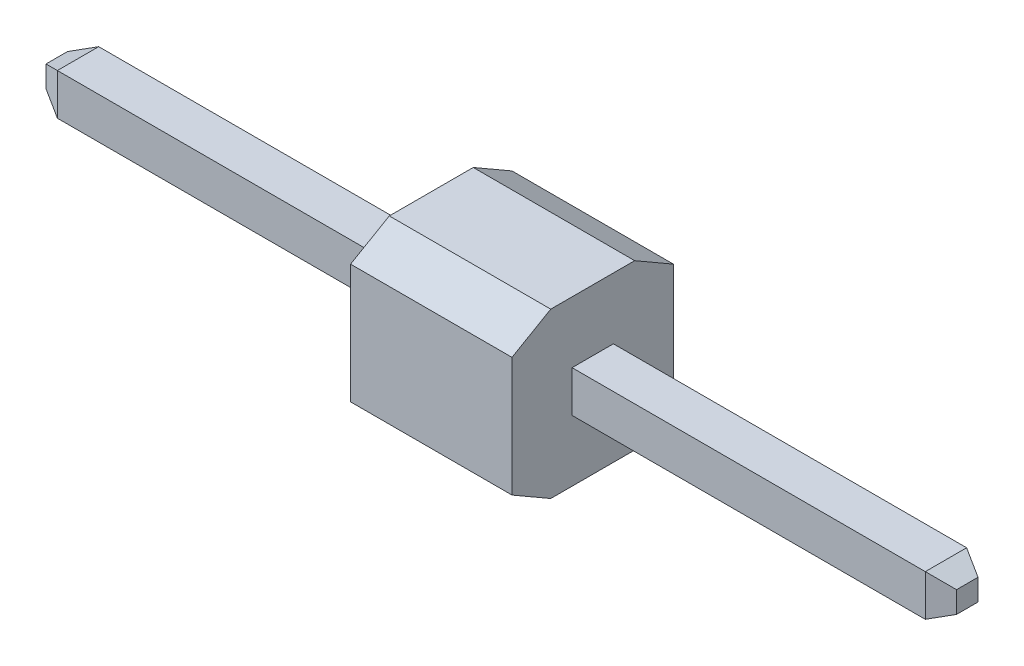
ISO-10303-21;
HEADER;
FILE_DESCRIPTION(('STEP AP214'),'2;1');
FILE_NAME('part.step','',(''),(''),'','','');
FILE_SCHEMA(('AUTOMOTIVE_DESIGN { 1 0 10303 214 1 1 1 1 }'));
ENDSEC;
DATA;
#1=APPLICATION_CONTEXT('core data for automotive mechanical design processes');
#2=APPLICATION_PROTOCOL_DEFINITION('international standard','automotive_design',2000,#1);
#3=PRODUCT_CONTEXT('',#1,'mechanical');
#4=PRODUCT('Part','Part','',(#3));
#5=PRODUCT_RELATED_PRODUCT_CATEGORY('part','',(#4));
#6=PRODUCT_DEFINITION_FORMATION('','',#4);
#7=PRODUCT_DEFINITION_CONTEXT('part definition',#1,'design');
#8=PRODUCT_DEFINITION('design','',#6,#7);
#9=PRODUCT_DEFINITION_SHAPE('','',#8);
#10=(LENGTH_UNIT() NAMED_UNIT(*) SI_UNIT(.MILLI.,.METRE.));
#11=(NAMED_UNIT(*) PLANE_ANGLE_UNIT() SI_UNIT($,.RADIAN.));
#12=(NAMED_UNIT(*) SI_UNIT($,.STERADIAN.) SOLID_ANGLE_UNIT());
#13=UNCERTAINTY_MEASURE_WITH_UNIT(LENGTH_MEASURE(1.E-05),#10,'distance_accuracy_value','');
#14=(GEOMETRIC_REPRESENTATION_CONTEXT(3) GLOBAL_UNCERTAINTY_ASSIGNED_CONTEXT((#13)) GLOBAL_UNIT_ASSIGNED_CONTEXT((#10,
#11,#12)) REPRESENTATION_CONTEXT('',''));
#15=CARTESIAN_POINT('',(0.,0.,0.));
#16=DIRECTION('',(0.,0.,1.));
#17=DIRECTION('',(1.,0.,0.));
#18=AXIS2_PLACEMENT_3D('',#15,#16,#17);
#19=CARTESIAN_POINT('',(5.42105070514841,-13.0171282629139,0.629998634255617));
#20=DIRECTION('',(1.,4.37113882867379E-08,-4.37113882867379E-08));
#21=DIRECTION('',(-4.37113882867379E-08,1.,0.));
#22=AXIS2_PLACEMENT_3D('',#19,#20,#21);
#23=PLANE('',#22);
#24=DIRECTION('',(1.59994777304463E-08,0.50000000000019,0.866025403784329));
#25=VECTOR('',#24,1.);
#26=CARTESIAN_POINT('',(5.4210505821625,-11.7735384244239,-0.940001365744382));
#27=LINE('',#26,#25);
#28=CARTESIAN_POINT('',(5.4210505821625,-11.7735384244239,-0.940001365744382));
#29=VERTEX_POINT('',#28);
#30=CARTESIAN_POINT('',(5.42105059324726,-11.4271282629139,-0.340001365744383));
#31=VERTEX_POINT('',#30);
#32=EDGE_CURVE('E11',#29,#31,#27,.T.);
#33=ORIENTED_EDGE('',*,*,#32,.T.);
#34=DIRECTION('',(4.37113880134522E-08,0.,0.999999999999999));
#35=VECTOR('',#34,1.);
#36=CARTESIAN_POINT('',(5.42105059324726,-11.4271282629139,-0.340001365744383));
#37=LINE('',#36,#35);
#38=CARTESIAN_POINT('',(5.42105065007206,-11.4271282629139,0.959998634255618));
#39=VERTEX_POINT('',#38);
#40=EDGE_CURVE('E304',#31,#39,#37,.T.);
#41=ORIENTED_EDGE('',*,*,#40,.T.);
#42=DIRECTION('',(5.97108681645512E-08,-0.500000000000186,0.86602540378433));
#43=VECTOR('',#42,1.);
#44=CARTESIAN_POINT('',(5.42105065007206,-11.4271282629139,0.959998634255618));
#45=LINE('',#44,#43);
#46=CARTESIAN_POINT('',(5.42105069144097,-11.7735384244239,1.55999863425562));
#47=VERTEX_POINT('',#46);
#48=EDGE_CURVE('E296',#39,#47,#45,.T.);
#49=ORIENTED_EDGE('',*,*,#48,.T.);
#50=DIRECTION('',(4.37113884815545E-08,-0.999999999999999,0.));
#51=VECTOR('',#50,1.);
#52=CARTESIAN_POINT('',(5.42105069144097,-11.7735384244239,1.55999863425562));
#53=LINE('',#52,#51);
#54=CARTESIAN_POINT('',(5.42105077218375,-13.6207181013939,1.55999863425562));
#55=VERTEX_POINT('',#54);
#56=EDGE_CURVE('E281',#47,#55,#53,.T.);
#57=ORIENTED_EDGE('',*,*,#56,.T.);
#58=DIRECTION('',(1.59994802942811E-08,0.500000000000195,0.866025403784326));
#59=VECTOR('',#58,1.);
#60=CARTESIAN_POINT('',(5.42105076109899,-13.9671282629139,0.959998634255618));
#61=LINE('',#60,#59);
#62=CARTESIAN_POINT('',(5.42105076109899,-13.9671282629139,0.959998634255618));
#63=VERTEX_POINT('',#62);
#64=EDGE_CURVE('E265',#63,#55,#61,.T.);
#65=ORIENTED_EDGE('',*,*,#64,.F.);
#66=DIRECTION('',(4.37113880134522E-08,0.,0.999999999999999));
#67=VECTOR('',#66,1.);
#68=CARTESIAN_POINT('',(5.42105070427419,-13.9671282629139,-0.340001365744383));
#69=LINE('',#68,#67);
#70=CARTESIAN_POINT('',(5.42105070427419,-13.9671282629139,-0.340001365744383));
#71=VERTEX_POINT('',#70);
#72=EDGE_CURVE('E248',#71,#63,#69,.T.);
#73=ORIENTED_EDGE('',*,*,#72,.F.);
#74=DIRECTION('',(5.97108656001698E-08,-0.50000000000019,0.866025403784327));
#75=VECTOR('',#74,1.);
#76=CARTESIAN_POINT('',(5.42105066290528,-13.6207181013939,-0.940001365744382));
#77=LINE('',#76,#75);
#78=CARTESIAN_POINT('',(5.42105066290528,-13.6207181013939,-0.940001365744382));
#79=VERTEX_POINT('',#78);
#80=EDGE_CURVE('E242',#79,#71,#77,.T.);
#81=ORIENTED_EDGE('',*,*,#80,.F.);
#82=DIRECTION('',(4.37113884815545E-08,-0.999999999999999,0.));
#83=VECTOR('',#82,1.);
#84=CARTESIAN_POINT('',(5.4210505821625,-11.7735384244239,-0.940001365744382));
#85=LINE('',#84,#83);
#86=EDGE_CURVE('E236',#29,#79,#85,.T.);
#87=ORIENTED_EDGE('',*,*,#86,.F.);
#88=EDGE_LOOP('',(#33,#41,#49,#57,#65,#73,#81,#87));
#89=FACE_BOUND('',#88,.T.);
#90=DIRECTION('',(-4.37113872875372E-08,0.,-0.999999999999999));
#91=VECTOR('',#90,1.);
#92=CARTESIAN_POINT('',(5.42105067717312,-12.3771282629139,0.629998634255617));
#93=LINE('',#92,#91);
#94=CARTESIAN_POINT('',(5.42105067717312,-12.3771282629139,0.629998634255617));
#95=VERTEX_POINT('',#94);
#96=CARTESIAN_POINT('',(5.42105064919784,-12.3771282629139,-0.0100013657443826));
#97=VERTEX_POINT('',#96);
#98=EDGE_CURVE('E302',#95,#97,#93,.T.);
#99=ORIENTED_EDGE('',*,*,#98,.T.);
#100=DIRECTION('',(-4.37113872875374E-08,0.999999999999999,0.));
#101=VECTOR('',#100,1.);
#102=CARTESIAN_POINT('',(5.42105067717312,-13.0171282629139,-0.0100013657443826));
#103=LINE('',#102,#101);
#104=CARTESIAN_POINT('',(5.42105067717312,-13.0171282629139,-0.0100013657443826));
#105=VERTEX_POINT('',#104);
#106=EDGE_CURVE('E293',#105,#97,#103,.T.);
#107=ORIENTED_EDGE('',*,*,#106,.F.);
#108=DIRECTION('',(-4.37113886753159E-08,0.,-0.999999999999999));
#109=VECTOR('',#108,1.);
#110=CARTESIAN_POINT('',(5.42105070514841,-13.0171282629139,0.629998634255617));
#111=LINE('',#110,#109);
#112=CARTESIAN_POINT('',(5.42105070514841,-13.0171282629139,0.629998634255617));
#113=VERTEX_POINT('',#112);
#114=EDGE_CURVE('E278',#113,#105,#111,.T.);
#115=ORIENTED_EDGE('',*,*,#114,.F.);
#116=DIRECTION('',(-4.37113886753161E-08,0.999999999999999,0.));
#117=VECTOR('',#116,1.);
#118=CARTESIAN_POINT('',(5.42105070514841,-13.0171282629139,0.629998634255617));
#119=LINE('',#118,#117);
#120=EDGE_CURVE('E263',#113,#95,#119,.T.);
#121=ORIENTED_EDGE('',*,*,#120,.T.);
#122=EDGE_LOOP('',(#99,#107,#115,#121));
#123=FACE_BOUND('',#122,.T.);
#124=ADVANCED_FACE('F17',(#89,#123),#23,.T.);
#125=CARTESIAN_POINT('',(2.92105070514841,-13.0171283721924,0.629998743534088));
#126=DIRECTION('',(1.,4.37113882867379E-08,-4.37113882867379E-08));
#127=DIRECTION('',(-4.37113882867379E-08,1.,0.));
#128=AXIS2_PLACEMENT_3D('',#125,#126,#127);
#129=PLANE('',#128);
#130=DIRECTION('',(1.59994790124215E-08,0.50000000000019,0.866025403784329));
#131=VECTOR('',#130,1.);
#132=CARTESIAN_POINT('',(2.92105058216249,-11.7735385337024,-0.940001256465912));
#133=LINE('',#132,#131);
#134=CARTESIAN_POINT('',(2.92105058216249,-11.7735385337024,-0.940001256465912));
#135=VERTEX_POINT('',#134);
#136=CARTESIAN_POINT('',(2.92105059324726,-11.4271283721924,-0.340001256465912));
#137=VERTEX_POINT('',#136);
#138=EDGE_CURVE('E24',#135,#137,#133,.T.);
#139=ORIENTED_EDGE('',*,*,#138,.F.);
#140=DIRECTION('',(4.37113884815545E-08,-0.999999999999999,0.));
#141=VECTOR('',#140,1.);
#142=CARTESIAN_POINT('',(2.92105058216249,-11.7735385337024,-0.940001256465912));
#143=LINE('',#142,#141);
#144=CARTESIAN_POINT('',(2.92105066290528,-13.6207182106724,-0.940001256465912));
#145=VERTEX_POINT('',#144);
#146=EDGE_CURVE('E300',#135,#145,#143,.T.);
#147=ORIENTED_EDGE('',*,*,#146,.T.);
#148=DIRECTION('',(5.97108662411574E-08,-0.50000000000019,0.866025403784327));
#149=VECTOR('',#148,1.);
#150=CARTESIAN_POINT('',(2.92105066290528,-13.6207182106724,-0.940001256465912));
#151=LINE('',#150,#149);
#152=CARTESIAN_POINT('',(2.92105070427419,-13.9671283721924,-0.340001256465912));
#153=VERTEX_POINT('',#152);
#154=EDGE_CURVE('E286',#145,#153,#151,.T.);
#155=ORIENTED_EDGE('',*,*,#154,.T.);
#156=DIRECTION('',(4.37113883550593E-08,0.,0.999999999999999));
#157=VECTOR('',#156,1.);
#158=CARTESIAN_POINT('',(2.92105070427419,-13.9671283721924,-0.340001256465912));
#159=LINE('',#158,#157);
#160=CARTESIAN_POINT('',(2.92105076109899,-13.9671283721924,0.959998743534088));
#161=VERTEX_POINT('',#160);
#162=EDGE_CURVE('E271',#153,#161,#159,.T.);
#163=ORIENTED_EDGE('',*,*,#162,.T.);
#164=DIRECTION('',(1.59994790123059E-08,0.500000000000195,0.866025403784326));
#165=VECTOR('',#164,1.);
#166=CARTESIAN_POINT('',(2.92105076109899,-13.9671283721924,0.959998743534088));
#167=LINE('',#166,#165);
#168=CARTESIAN_POINT('',(2.92105077218375,-13.6207182106724,1.55999874353409));
#169=VERTEX_POINT('',#168);
#170=EDGE_CURVE('E253',#161,#169,#167,.T.);
#171=ORIENTED_EDGE('',*,*,#170,.T.);
#172=DIRECTION('',(4.37113884815545E-08,-0.999999999999999,0.));
#173=VECTOR('',#172,1.);
#174=CARTESIAN_POINT('',(2.92105069144097,-11.7735385337024,1.55999874353409));
#175=LINE('',#174,#173);
#176=CARTESIAN_POINT('',(2.92105069144097,-11.7735385337024,1.55999874353409));
#177=VERTEX_POINT('',#176);
#178=EDGE_CURVE('E261',#177,#169,#175,.T.);
#179=ORIENTED_EDGE('',*,*,#178,.F.);
#180=DIRECTION('',(5.97108668825761E-08,-0.500000000000186,0.86602540378433));
#181=VECTOR('',#180,1.);
#182=CARTESIAN_POINT('',(2.92105065007206,-11.4271283721924,0.959998743534088));
#183=LINE('',#182,#181);
#184=CARTESIAN_POINT('',(2.92105065007206,-11.4271283721924,0.959998743534088));
#185=VERTEX_POINT('',#184);
#186=EDGE_CURVE('E276',#185,#177,#183,.T.);
#187=ORIENTED_EDGE('',*,*,#186,.F.);
#188=DIRECTION('',(4.37113880134522E-08,0.,0.999999999999999));
#189=VECTOR('',#188,1.);
#190=CARTESIAN_POINT('',(2.92105059324726,-11.4271283721924,-0.340001256465912));
#191=LINE('',#190,#189);
#192=EDGE_CURVE('E291',#137,#185,#191,.T.);
#193=ORIENTED_EDGE('',*,*,#192,.F.);
#194=EDGE_LOOP('',(#139,#147,#155,#163,#171,#179,#187,#193));
#195=FACE_BOUND('',#194,.T.);
#196=DIRECTION('',(-4.37113879814267E-08,0.999999999999999,0.));
#197=VECTOR('',#196,1.);
#198=CARTESIAN_POINT('',(2.92105067717312,-13.0171283721924,-0.0100012564659119));
#199=LINE('',#198,#197);
#200=CARTESIAN_POINT('',(2.92105067717312,-13.0171283721924,-0.0100012564659119));
#201=VERTEX_POINT('',#200);
#202=CARTESIAN_POINT('',(2.92105064919784,-12.3771283721924,-0.0100012564659119));
#203=VERTEX_POINT('',#202);
#204=EDGE_CURVE('E298',#201,#203,#199,.T.);
#205=ORIENTED_EDGE('',*,*,#204,.T.);
#206=DIRECTION('',(-4.37113879814266E-08,0.,-0.999999999999999));
#207=VECTOR('',#206,1.);
#208=CARTESIAN_POINT('',(2.92105067717312,-12.3771283721924,0.629998743534088));
#209=LINE('',#208,#207);
#210=CARTESIAN_POINT('',(2.92105067717312,-12.3771283721924,0.629998743534088));
#211=VERTEX_POINT('',#210);
#212=EDGE_CURVE('E283',#211,#203,#209,.T.);
#213=ORIENTED_EDGE('',*,*,#212,.F.);
#214=DIRECTION('',(-4.37113879814267E-08,0.999999999999999,0.));
#215=VECTOR('',#214,1.);
#216=CARTESIAN_POINT('',(2.92105070514841,-13.0171283721924,0.629998743534088));
#217=LINE('',#216,#215);
#218=CARTESIAN_POINT('',(2.92105070514841,-13.0171283721924,0.629998743534088));
#219=VERTEX_POINT('',#218);
#220=EDGE_CURVE('E268',#219,#211,#217,.T.);
#221=ORIENTED_EDGE('',*,*,#220,.F.);
#222=DIRECTION('',(-4.37113879814266E-08,0.,-0.999999999999999));
#223=VECTOR('',#222,1.);
#224=CARTESIAN_POINT('',(2.92105070514841,-13.0171283721924,0.629998743534088));
#225=LINE('',#224,#223);
#226=EDGE_CURVE('E251',#219,#201,#225,.T.);
#227=ORIENTED_EDGE('',*,*,#226,.T.);
#228=EDGE_LOOP('',(#205,#213,#221,#227));
#229=FACE_BOUND('',#228,.T.);
#230=ADVANCED_FACE('F314',(#195,#229),#129,.F.);
#231=CARTESIAN_POINT('',(5.4210505821625,-11.7735384244239,-0.940001365744382));
#232=DIRECTION('',(5.97108668343731E-08,-0.866025403784328,0.50000000000019));
#233=DIRECTION('',(-1.59994785476185E-08,-0.500000000000192,-0.866025403784329));
#234=AXIS2_PLACEMENT_3D('',#231,#232,#233);
#235=PLANE('',#234);
#236=ORIENTED_EDGE('',*,*,#138,.T.);
#237=DIRECTION('',(-0.999999999999998,-4.37113897078233E-08,4.37113883755557E-08));
#238=VECTOR('',#237,1.);
#239=CARTESIAN_POINT('',(5.42105059324726,-11.4271282629139,-0.340001365744383));
#240=LINE('',#239,#238);
#241=EDGE_CURVE('E288',#31,#137,#240,.T.);
#242=ORIENTED_EDGE('',*,*,#241,.F.);
#243=ORIENTED_EDGE('',*,*,#32,.F.);
#244=DIRECTION('',(-0.999999999999998,-4.37113868656524E-08,4.37113881091021E-08));
#245=VECTOR('',#244,1.);
#246=CARTESIAN_POINT('',(5.4210505821625,-11.7735384244239,-0.940001365744382));
#247=LINE('',#246,#245);
#248=EDGE_CURVE('E256',#29,#135,#247,.T.);
#249=ORIENTED_EDGE('',*,*,#248,.T.);
#250=EDGE_LOOP('',(#236,#242,#243,#249));
#251=FACE_BOUND('',#250,.T.);
#252=ADVANCED_FACE('F306',(#251),#235,.F.);
#253=CARTESIAN_POINT('',(5.42105059324726,-11.4271282629139,-0.340001365744383));
#254=DIRECTION('',(4.37113882867379E-08,-1.,0.));
#255=DIRECTION('',(1.,4.37113882867379E-08,-4.37113882867379E-08));
#256=AXIS2_PLACEMENT_3D('',#253,#254,#255);
#257=PLANE('',#256);
#258=ORIENTED_EDGE('',*,*,#192,.T.);
#259=DIRECTION('',(-0.999999999999998,-4.37113897078233E-08,4.37113882867378E-08));
#260=VECTOR('',#259,1.);
#261=CARTESIAN_POINT('',(5.42105065007206,-11.4271282629139,0.959998634255618));
#262=LINE('',#261,#260);
#263=EDGE_CURVE('E273',#39,#185,#262,.T.);
#264=ORIENTED_EDGE('',*,*,#263,.F.);
#265=ORIENTED_EDGE('',*,*,#40,.F.);
#266=ORIENTED_EDGE('',*,*,#241,.T.);
#267=EDGE_LOOP('',(#258,#264,#265,#266));
#268=FACE_BOUND('',#267,.T.);
#269=ADVANCED_FACE('F311',(#268),#257,.F.);
#270=CARTESIAN_POINT('',(5.42105065007206,-11.4271282629139,0.959998634255618));
#271=DIRECTION('',(1.59994785476185E-08,-0.86602540378433,-0.50000000000019));
#272=DIRECTION('',(-5.97108668343731E-08,0.500000000000188,-0.866025403784329));
#273=AXIS2_PLACEMENT_3D('',#270,#271,#272);
#274=PLANE('',#273);
#275=ORIENTED_EDGE('',*,*,#186,.T.);
#276=DIRECTION('',(-0.999999999999998,-4.37113868656524E-08,4.37113882867378E-08));
#277=VECTOR('',#276,1.);
#278=CARTESIAN_POINT('',(5.42105069144097,-11.7735384244239,1.55999863425562));
#279=LINE('',#278,#277);
#280=EDGE_CURVE('E258',#47,#177,#279,.T.);
#281=ORIENTED_EDGE('',*,*,#280,.F.);
#282=ORIENTED_EDGE('',*,*,#48,.F.);
#283=ORIENTED_EDGE('',*,*,#263,.T.);
#284=EDGE_LOOP('',(#275,#281,#282,#283));
#285=FACE_BOUND('',#284,.T.);
#286=ADVANCED_FACE('F319',(#285),#274,.F.);
#287=CARTESIAN_POINT('',(5.42105069144097,-11.7735384244239,1.55999863425562));
#288=DIRECTION('',(-4.37113882867379E-08,0.,-1.));
#289=DIRECTION('',(-1.,-4.37113882867379E-08,4.37113882867379E-08));
#290=AXIS2_PLACEMENT_3D('',#287,#288,#289);
#291=PLANE('',#290);
#292=ORIENTED_EDGE('',*,*,#178,.T.);
#293=DIRECTION('',(-0.999999999999998,-4.37113897078233E-08,4.37113882867378E-08));
#294=VECTOR('',#293,1.);
#295=CARTESIAN_POINT('',(5.42105077218375,-13.6207181013939,1.55999863425562));
#296=LINE('',#295,#294);
#297=EDGE_CURVE('E245',#55,#169,#296,.T.);
#298=ORIENTED_EDGE('',*,*,#297,.F.);
#299=ORIENTED_EDGE('',*,*,#56,.F.);
#300=ORIENTED_EDGE('',*,*,#280,.T.);
#301=EDGE_LOOP('',(#292,#298,#299,#300));
#302=FACE_BOUND('',#301,.T.);
#303=ADVANCED_FACE('F326',(#302),#291,.F.);
#304=CARTESIAN_POINT('',(5.42105076109899,-13.9671282629139,0.959998634255618));
#305=DIRECTION('',(5.97108668343731E-08,-0.866025403784328,0.50000000000019));
#306=DIRECTION('',(-1.59994785476185E-08,-0.500000000000192,-0.866025403784329));
#307=AXIS2_PLACEMENT_3D('',#304,#305,#306);
#308=PLANE('',#307);
#309=ORIENTED_EDGE('',*,*,#170,.F.);
#310=DIRECTION('',(-0.999999999999998,-4.37113854445669E-08,4.37113882867378E-08));
#311=VECTOR('',#310,1.);
#312=CARTESIAN_POINT('',(5.42105076109899,-13.9671282629139,0.959998634255618));
#313=LINE('',#312,#311);
#314=EDGE_CURVE('E239',#63,#161,#313,.T.);
#315=ORIENTED_EDGE('',*,*,#314,.F.);
#316=ORIENTED_EDGE('',*,*,#64,.T.);
#317=ORIENTED_EDGE('',*,*,#297,.T.);
#318=EDGE_LOOP('',(#309,#315,#316,#317));
#319=FACE_BOUND('',#318,.T.);
#320=ADVANCED_FACE('F329',(#319),#308,.T.);
#321=CARTESIAN_POINT('',(5.42105070427419,-13.9671282629139,-0.340001365744383));
#322=DIRECTION('',(4.37113882867379E-08,-1.,0.));
#323=DIRECTION('',(1.,4.37113882867379E-08,-4.37113882867379E-08));
#324=AXIS2_PLACEMENT_3D('',#321,#322,#323);
#325=PLANE('',#324);
#326=ORIENTED_EDGE('',*,*,#162,.F.);
#327=DIRECTION('',(-0.999999999999998,-4.37113854445669E-08,4.37113883755557E-08));
#328=VECTOR('',#327,1.);
#329=CARTESIAN_POINT('',(5.42105070427419,-13.9671282629139,-0.340001365744383));
#330=LINE('',#329,#328);
#331=EDGE_CURVE('E233',#71,#153,#330,.T.);
#332=ORIENTED_EDGE('',*,*,#331,.F.);
#333=ORIENTED_EDGE('',*,*,#72,.T.);
#334=ORIENTED_EDGE('',*,*,#314,.T.);
#335=EDGE_LOOP('',(#326,#332,#333,#334));
#336=FACE_BOUND('',#335,.T.);
#337=ADVANCED_FACE('F333',(#336),#325,.T.);
#338=CARTESIAN_POINT('',(5.42105066290528,-13.6207181013939,-0.940001365744382));
#339=DIRECTION('',(1.59994785476185E-08,-0.86602540378433,-0.50000000000019));
#340=DIRECTION('',(-5.97108668343731E-08,0.500000000000188,-0.866025403784329));
#341=AXIS2_PLACEMENT_3D('',#338,#339,#340);
#342=PLANE('',#341);
#343=ORIENTED_EDGE('',*,*,#154,.F.);
#344=DIRECTION('',(-0.999999999999998,-4.37113897078233E-08,4.37113881091021E-08));
#345=VECTOR('',#344,1.);
#346=CARTESIAN_POINT('',(5.42105066290528,-13.6207181013939,-0.940001365744382));
#347=LINE('',#346,#345);
#348=EDGE_CURVE('E230',#79,#145,#347,.T.);
#349=ORIENTED_EDGE('',*,*,#348,.F.);
#350=ORIENTED_EDGE('',*,*,#80,.T.);
#351=ORIENTED_EDGE('',*,*,#331,.T.);
#352=EDGE_LOOP('',(#343,#349,#350,#351));
#353=FACE_BOUND('',#352,.T.);
#354=ADVANCED_FACE('F337',(#353),#342,.T.);
#355=CARTESIAN_POINT('',(5.4210505821625,-11.7735384244239,-0.940001365744382));
#356=DIRECTION('',(-4.37113882867379E-08,0.,-1.));
#357=DIRECTION('',(-4.37113882867379E-08,1.,0.));
#358=AXIS2_PLACEMENT_3D('',#355,#356,#357);
#359=PLANE('',#358);
#360=ORIENTED_EDGE('',*,*,#146,.F.);
#361=ORIENTED_EDGE('',*,*,#248,.F.);
#362=ORIENTED_EDGE('',*,*,#86,.T.);
#363=ORIENTED_EDGE('',*,*,#348,.T.);
#364=EDGE_LOOP('',(#360,#361,#362,#363));
#365=FACE_BOUND('',#364,.T.);
#366=ADVANCED_FACE('F339',(#365),#359,.T.);
#367=CARTESIAN_POINT('',(-2.87894929485159,-13.0171286257184,0.62999899706014));
#368=DIRECTION('',(-1.,-4.37113882867379E-08,4.37113882867379E-08));
#369=DIRECTION('',(4.37113882867379E-08,-1.,0.));
#370=AXIS2_PLACEMENT_3D('',#367,#368,#369);
#371=PLANE('',#370);
#372=DIRECTION('',(4.37113900757526E-08,-0.999999999999999,0.));
#373=VECTOR('',#372,1.);
#374=CARTESIAN_POINT('',(-2.87894933734941,-12.5310101529084,0.14388052425114));
#375=LINE('',#374,#373);
#376=CARTESIAN_POINT('',(-2.87894933734941,-12.5310101529084,0.14388052425114));
#377=VERTEX_POINT('',#376);
#378=CARTESIAN_POINT('',(-2.87894932282688,-12.8632470985184,0.14388052425114));
#379=VERTEX_POINT('',#378);
#380=EDGE_CURVE('E228',#377,#379,#375,.T.);
#381=ORIENTED_EDGE('',*,*,#380,.T.);
#382=DIRECTION('',(4.37113900746999E-08,0.,0.999999999999999));
#383=VECTOR('',#382,1.);
#384=CARTESIAN_POINT('',(-2.87894932282688,-12.8632470985184,0.14388052425114));
#385=LINE('',#384,#383);
#386=CARTESIAN_POINT('',(-2.87894930830434,-12.8632470985184,0.47611746986914));
#387=VERTEX_POINT('',#386);
#388=EDGE_CURVE('E223',#379,#387,#385,.T.);
#389=ORIENTED_EDGE('',*,*,#388,.T.);
#390=DIRECTION('',(-4.37113874024243E-08,0.999999999999999,0.));
#391=VECTOR('',#390,1.);
#392=CARTESIAN_POINT('',(-2.87894930830434,-12.8632470985184,0.47611746986914));
#393=LINE('',#392,#391);
#394=CARTESIAN_POINT('',(-2.87894932282688,-12.5310101529084,0.47611746986914));
#395=VERTEX_POINT('',#394);
#396=EDGE_CURVE('E215',#387,#395,#393,.T.);
#397=ORIENTED_EDGE('',*,*,#396,.T.);
#398=DIRECTION('',(-4.37113820547151E-08,0.,-0.999999999999999));
#399=VECTOR('',#398,1.);
#400=CARTESIAN_POINT('',(-2.87894932282688,-12.5310101529084,0.47611746986914));
#401=LINE('',#400,#399);
#402=EDGE_CURVE('E207',#395,#377,#401,.T.);
#403=ORIENTED_EDGE('',*,*,#402,.T.);
#404=EDGE_LOOP('',(#381,#389,#397,#403));
#405=FACE_BOUND('',#404,.T.);
#406=ADVANCED_FACE('F341',(#405),#371,.T.);
#407=CARTESIAN_POINT('',(-2.87894929485159,-13.0171286257184,0.62999899706014));
#408=DIRECTION('',(4.37113882867379E-08,-1.,0.));
#409=DIRECTION('',(-4.37113882867379E-08,0.,-1.));
#410=AXIS2_PLACEMENT_3D('',#407,#408,#409);
#411=PLANE('',#410);
#412=DIRECTION('',(0.999999999999998,4.37113868968279E-08,-4.37113882769955E-08));
#413=VECTOR('',#412,1.);
#414=CARTESIAN_POINT('',(-2.54894929485159,-13.0171286112937,0.629998982635382));
#415=LINE('',#414,#413);
#416=CARTESIAN_POINT('',(-2.54894929485159,-13.0171286112937,0.629998982635382));
#417=VERTEX_POINT('',#416);
#418=EDGE_CURVE('E225',#417,#219,#415,.T.);
#419=ORIENTED_EDGE('',*,*,#418,.F.);
#420=DIRECTION('',(-4.37113886753159E-08,0.,-0.999999999999999));
#421=VECTOR('',#420,1.);
#422=CARTESIAN_POINT('',(-2.54894929485159,-13.0171286112937,0.629998982635382));
#423=LINE('',#422,#421);
#424=CARTESIAN_POINT('',(-2.54894932282688,-13.0171286112937,-0.010001017364618));
#425=VERTEX_POINT('',#424);
#426=EDGE_CURVE('E217',#417,#425,#423,.T.);
#427=ORIENTED_EDGE('',*,*,#426,.T.);
#428=DIRECTION('',(0.999999999999998,4.37113868968279E-08,-4.37113882161057E-08));
#429=VECTOR('',#428,1.);
#430=CARTESIAN_POINT('',(-2.54894932282688,-13.0171286112937,-0.010001017364618));
#431=LINE('',#430,#429);
#432=EDGE_CURVE('E220',#425,#201,#431,.T.);
#433=ORIENTED_EDGE('',*,*,#432,.T.);
#434=ORIENTED_EDGE('',*,*,#226,.F.);
#435=EDGE_LOOP('',(#419,#427,#433,#434));
#436=FACE_BOUND('',#435,.T.);
#437=ADVANCED_FACE('F348',(#436),#411,.T.);
#438=CARTESIAN_POINT('',(-2.87894932282688,-13.0171286257184,-0.0100010029398598));
#439=DIRECTION('',(-4.37113882867379E-08,0.,-1.));
#440=DIRECTION('',(-1.,-4.37113882867379E-08,4.37113882867379E-08));
#441=AXIS2_PLACEMENT_3D('',#438,#439,#440);
#442=PLANE('',#441);
#443=ORIENTED_EDGE('',*,*,#432,.F.);
#444=DIRECTION('',(-4.37113872875374E-08,0.999999999999999,0.));
#445=VECTOR('',#444,1.);
#446=CARTESIAN_POINT('',(-2.54894932282688,-13.0171286112937,-0.010001017364618));
#447=LINE('',#446,#445);
#448=CARTESIAN_POINT('',(-2.54894935080216,-12.3771286112937,-0.010001017364618));
#449=VERTEX_POINT('',#448);
#450=EDGE_CURVE('E209',#425,#449,#447,.T.);
#451=ORIENTED_EDGE('',*,*,#450,.T.);
#452=DIRECTION('',(0.999999999999998,4.37113868968279E-08,-4.37113882161057E-08));
#453=VECTOR('',#452,1.);
#454=CARTESIAN_POINT('',(-2.54894935080216,-12.3771286112937,-0.010001017364618));
#455=LINE('',#454,#453);
#456=EDGE_CURVE('E212',#449,#203,#455,.T.);
#457=ORIENTED_EDGE('',*,*,#456,.T.);
#458=ORIENTED_EDGE('',*,*,#204,.F.);
#459=EDGE_LOOP('',(#443,#451,#457,#458));
#460=FACE_BOUND('',#459,.T.);
#461=ADVANCED_FACE('F424',(#460),#442,.T.);
#462=CARTESIAN_POINT('',(-2.87894932282688,-12.3771286257184,0.62999899706014));
#463=DIRECTION('',(4.37113882867379E-08,-1.,0.));
#464=DIRECTION('',(-4.37113882867379E-08,0.,-1.));
#465=AXIS2_PLACEMENT_3D('',#462,#463,#464);
#466=PLANE('',#465);
#467=ORIENTED_EDGE('',*,*,#456,.F.);
#468=DIRECTION('',(4.37113886753159E-08,0.,0.999999999999999));
#469=VECTOR('',#468,1.);
#470=CARTESIAN_POINT('',(-2.54894935080216,-12.3771286112937,-0.010001017364618));
#471=LINE('',#470,#469);
#472=CARTESIAN_POINT('',(-2.54894932282688,-12.3771286112937,0.629998982635382));
#473=VERTEX_POINT('',#472);
#474=EDGE_CURVE('E201',#449,#473,#471,.T.);
#475=ORIENTED_EDGE('',*,*,#474,.T.);
#476=DIRECTION('',(0.999999999999998,4.37113868968279E-08,-4.37113882769955E-08));
#477=VECTOR('',#476,1.);
#478=CARTESIAN_POINT('',(-2.54894932282688,-12.3771286112937,0.629998982635382));
#479=LINE('',#478,#477);
#480=EDGE_CURVE('E204',#473,#211,#479,.T.);
#481=ORIENTED_EDGE('',*,*,#480,.T.);
#482=ORIENTED_EDGE('',*,*,#212,.T.);
#483=EDGE_LOOP('',(#467,#475,#481,#482));
#484=FACE_BOUND('',#483,.T.);
#485=ADVANCED_FACE('F421',(#484),#466,.F.);
#486=CARTESIAN_POINT('',(-2.87894929485159,-13.0171286257184,0.62999899706014));
#487=DIRECTION('',(-4.37113882867379E-08,0.,-1.));
#488=DIRECTION('',(-1.,-4.37113882867379E-08,4.37113882867379E-08));
#489=AXIS2_PLACEMENT_3D('',#486,#487,#488);
#490=PLANE('',#489);
#491=ORIENTED_EDGE('',*,*,#480,.F.);
#492=DIRECTION('',(4.37113872875374E-08,-0.999999999999999,0.));
#493=VECTOR('',#492,1.);
#494=CARTESIAN_POINT('',(-2.54894932282688,-12.3771286112937,0.629998982635382));
#495=LINE('',#494,#493);
#496=EDGE_CURVE('E196',#473,#417,#495,.T.);
#497=ORIENTED_EDGE('',*,*,#496,.T.);
#498=ORIENTED_EDGE('',*,*,#418,.T.);
#499=ORIENTED_EDGE('',*,*,#220,.T.);
#500=EDGE_LOOP('',(#491,#497,#498,#499));
#501=FACE_BOUND('',#500,.T.);
#502=ADVANCED_FACE('F376',(#501),#490,.F.);
#503=CARTESIAN_POINT('',(-2.87894929485159,-13.0171286257184,0.62999899706014));
#504=DIRECTION('',(-4.37113882867379E-08,0.,-1.));
#505=DIRECTION('',(-1.,-4.37113882867379E-08,4.37113882867379E-08));
#506=AXIS2_PLACEMENT_3D('',#503,#504,#505);
#507=PLANE('',#506);
#508=DIRECTION('',(0.999999999999998,4.37113778039593E-08,-4.37113882769955E-08));
#509=VECTOR('',#508,1.);
#510=CARTESIAN_POINT('',(5.42105070514841,-13.0171282629139,0.629998634255617));
#511=LINE('',#510,#509);
#512=CARTESIAN_POINT('',(10.8910507051484,-13.0171280238126,0.629998395154324));
#513=VERTEX_POINT('',#512);
#514=EDGE_CURVE('E199',#113,#513,#511,.T.);
#515=ORIENTED_EDGE('',*,*,#514,.T.);
#516=DIRECTION('',(-4.37113872875374E-08,0.999999999999999,0.));
#517=VECTOR('',#516,1.);
#518=CARTESIAN_POINT('',(10.8910507051484,-13.0171280238126,0.629998395154324));
#519=LINE('',#518,#517);
#520=CARTESIAN_POINT('',(10.8910506771731,-12.3771280238126,0.629998395154324));
#521=VERTEX_POINT('',#520);
#522=EDGE_CURVE('E191',#513,#521,#519,.T.);
#523=ORIENTED_EDGE('',*,*,#522,.T.);
#524=DIRECTION('',(0.999999999999998,4.37113933917341E-08,-4.37113882769955E-08));
#525=VECTOR('',#524,1.);
#526=CARTESIAN_POINT('',(5.42105067717312,-12.3771282629139,0.629998634255617));
#527=LINE('',#526,#525);
#528=EDGE_CURVE('E194',#95,#521,#527,.T.);
#529=ORIENTED_EDGE('',*,*,#528,.F.);
#530=ORIENTED_EDGE('',*,*,#120,.F.);
#531=EDGE_LOOP('',(#515,#523,#529,#530));
#532=FACE_BOUND('',#531,.T.);
#533=ADVANCED_FACE('F367',(#532),#507,.F.);
#534=CARTESIAN_POINT('',(-2.87894932282688,-12.3771286257184,0.62999899706014));
#535=DIRECTION('',(4.37113882867379E-08,-1.,0.));
#536=DIRECTION('',(-4.37113882867379E-08,0.,-1.));
#537=AXIS2_PLACEMENT_3D('',#534,#535,#536);
#538=PLANE('',#537);
#539=ORIENTED_EDGE('',*,*,#528,.T.);
#540=DIRECTION('',(-4.37113872875372E-08,0.,-0.999999999999999));
#541=VECTOR('',#540,1.);
#542=CARTESIAN_POINT('',(10.8910506771731,-12.3771280238126,0.629998395154324));
#543=LINE('',#542,#541);
#544=CARTESIAN_POINT('',(10.8910506491978,-12.3771280238126,-0.0100016048456765));
#545=VERTEX_POINT('',#544);
#546=EDGE_CURVE('E186',#521,#545,#543,.T.);
#547=ORIENTED_EDGE('',*,*,#546,.T.);
#548=DIRECTION('',(0.999999999999998,4.37113933917341E-08,-4.37113881146228E-08));
#549=VECTOR('',#548,1.);
#550=CARTESIAN_POINT('',(5.42105064919784,-12.3771282629139,-0.0100013657443823));
#551=LINE('',#550,#549);
#552=EDGE_CURVE('E189',#97,#545,#551,.T.);
#553=ORIENTED_EDGE('',*,*,#552,.F.);
#554=ORIENTED_EDGE('',*,*,#98,.F.);
#555=EDGE_LOOP('',(#539,#547,#553,#554));
#556=FACE_BOUND('',#555,.T.);
#557=ADVANCED_FACE('F364',(#556),#538,.F.);
#558=CARTESIAN_POINT('',(-2.87894932282688,-13.0171286257184,-0.0100010029398598));
#559=DIRECTION('',(-4.37113882867379E-08,0.,-1.));
#560=DIRECTION('',(-1.,-4.37113882867379E-08,4.37113882867379E-08));
#561=AXIS2_PLACEMENT_3D('',#558,#559,#560);
#562=PLANE('',#561);
#563=ORIENTED_EDGE('',*,*,#552,.T.);
#564=DIRECTION('',(4.37113872875374E-08,-0.999999999999999,0.));
#565=VECTOR('',#564,1.);
#566=CARTESIAN_POINT('',(10.8910506491978,-12.3771280238126,-0.0100016048456765));
#567=LINE('',#566,#565);
#568=CARTESIAN_POINT('',(10.8910506771731,-13.0171280238126,-0.0100016048456765));
#569=VERTEX_POINT('',#568);
#570=EDGE_CURVE('E176',#545,#569,#567,.T.);
#571=ORIENTED_EDGE('',*,*,#570,.T.);
#572=DIRECTION('',(0.999999999999998,4.37113778039593E-08,-4.37113881146228E-08));
#573=VECTOR('',#572,1.);
#574=CARTESIAN_POINT('',(5.42105067717312,-13.0171282629139,-0.0100013657443823));
#575=LINE('',#574,#573);
#576=EDGE_CURVE('E179',#105,#569,#575,.T.);
#577=ORIENTED_EDGE('',*,*,#576,.F.);
#578=ORIENTED_EDGE('',*,*,#106,.T.);
#579=EDGE_LOOP('',(#563,#571,#577,#578));
#580=FACE_BOUND('',#579,.T.);
#581=ADVANCED_FACE('F366',(#580),#562,.T.);
#582=CARTESIAN_POINT('',(-2.87894929485159,-13.0171286257184,0.62999899706014));
#583=DIRECTION('',(4.37113882867379E-08,-1.,0.));
#584=DIRECTION('',(-4.37113882867379E-08,0.,-1.));
#585=AXIS2_PLACEMENT_3D('',#582,#583,#584);
#586=PLANE('',#585);
#587=ORIENTED_EDGE('',*,*,#576,.T.);
#588=DIRECTION('',(4.37113872875372E-08,0.,0.999999999999999));
#589=VECTOR('',#588,1.);
#590=CARTESIAN_POINT('',(10.8910506771731,-13.0171280238126,-0.0100016048456765));
#591=LINE('',#590,#589);
#592=EDGE_CURVE('E167',#569,#513,#591,.T.);
#593=ORIENTED_EDGE('',*,*,#592,.T.);
#594=ORIENTED_EDGE('',*,*,#514,.F.);
#595=ORIENTED_EDGE('',*,*,#114,.T.);
#596=EDGE_LOOP('',(#587,#593,#594,#595));
#597=FACE_BOUND('',#596,.T.);
#598=ADVANCED_FACE('F373',(#597),#586,.T.);
#599=CARTESIAN_POINT('',(11.2210507051484,-13.0171280093879,0.629998380729565));
#600=DIRECTION('',(-1.,-4.37113882867379E-08,4.37113882867379E-08));
#601=DIRECTION('',(4.37113882867379E-08,-1.,0.));
#602=AXIS2_PLACEMENT_3D('',#599,#600,#601);
#603=PLANE('',#602);
#604=DIRECTION('',(-4.37113874024243E-08,0.999999999999999,0.));
#605=VECTOR('',#604,1.);
#606=CARTESIAN_POINT('',(11.2210506771731,-12.8632464821879,0.143879907920565));
#607=LINE('',#606,#605);
#608=CARTESIAN_POINT('',(11.2210506771731,-12.8632464821879,0.143879907920565));
#609=VERTEX_POINT('',#608);
#610=CARTESIAN_POINT('',(11.2210506626506,-12.5310095365779,0.143879907920565));
#611=VERTEX_POINT('',#610);
#612=EDGE_CURVE('E153',#609,#611,#607,.T.);
#613=ORIENTED_EDGE('',*,*,#612,.T.);
#614=DIRECTION('',(4.37113874013716E-08,0.,0.999999999999999));
#615=VECTOR('',#614,1.);
#616=CARTESIAN_POINT('',(11.2210506626506,-12.5310095365779,0.143879907920565));
#617=LINE('',#616,#615);
#618=CARTESIAN_POINT('',(11.2210506771731,-12.5310095365779,0.476116853538565));
#619=VERTEX_POINT('',#618);
#620=EDGE_CURVE('E395',#611,#619,#617,.T.);
#621=ORIENTED_EDGE('',*,*,#620,.T.);
#622=DIRECTION('',(4.37113874024243E-08,-0.999999999999999,0.));
#623=VECTOR('',#622,1.);
#624=CARTESIAN_POINT('',(11.2210506771731,-12.5310095365779,0.476116853538565));
#625=LINE('',#624,#623);
#626=CARTESIAN_POINT('',(11.2210506916957,-12.8632464821879,0.476116853538565));
#627=VERTEX_POINT('',#626);
#628=EDGE_CURVE('E156',#619,#627,#625,.T.);
#629=ORIENTED_EDGE('',*,*,#628,.T.);
#630=DIRECTION('',(-4.37113927480282E-08,0.,-0.999999999999999));
#631=VECTOR('',#630,1.);
#632=CARTESIAN_POINT('',(11.2210506916957,-12.8632464821879,0.476116853538565));
#633=LINE('',#632,#631);
#634=EDGE_CURVE('E149',#627,#609,#633,.T.);
#635=ORIENTED_EDGE('',*,*,#634,.T.);
#636=EDGE_LOOP('',(#613,#621,#629,#635));
#637=FACE_BOUND('',#636,.T.);
#638=ADVANCED_FACE('F151',(#637),#603,.F.);
#639=CARTESIAN_POINT('',(-2.8789493161005,-12.5310101529084,0.62999899706014));
#640=DIRECTION('',(-0.422618301356784,0.906307768563367,1.84732310895534E-08));
#641=DIRECTION('',(4.37113882867379E-08,0.,1.));
#642=AXIS2_PLACEMENT_3D('',#639,#640,#641);
#643=PLANE('',#642);
#644=DIRECTION('',(0.834817095446925,0.389281657126021,-0.389281657126018));
#645=VECTOR('',#644,1.);
#646=CARTESIAN_POINT('',(-2.87894933734943,-12.5310101529079,0.143880524251623));
#647=LINE('',#646,#645);
#648=EDGE_CURVE('E181',#377,#449,#647,.T.);
#649=ORIENTED_EDGE('',*,*,#648,.F.);
#650=ORIENTED_EDGE('',*,*,#402,.F.);
#651=DIRECTION('',(-0.834817129479003,-0.389281657126029,-0.389281584143985));
#652=VECTOR('',#651,1.);
#653=CARTESIAN_POINT('',(-2.54894932282731,-12.3771286112922,0.629998982634844));
#654=LINE('',#653,#652);
#655=EDGE_CURVE('E404',#473,#395,#654,.T.);
#656=ORIENTED_EDGE('',*,*,#655,.F.);
#657=ORIENTED_EDGE('',*,*,#474,.F.);
#658=EDGE_LOOP('',(#649,#650,#656,#657));
#659=FACE_BOUND('',#658,.T.);
#660=ADVANCED_FACE('F418',(#659),#643,.T.);
#661=CARTESIAN_POINT('',(-2.87894930157796,-13.0171286257184,0.47611746986914));
#662=DIRECTION('',(-0.422618222124841,-1.84732292043498E-08,0.906307805509828));
#663=DIRECTION('',(4.37113882867379E-08,-1.,0.));
#664=AXIS2_PLACEMENT_3D('',#661,#662,#663);
#665=PLANE('',#664);
#666=ORIENTED_EDGE('',*,*,#655,.T.);
#667=ORIENTED_EDGE('',*,*,#396,.F.);
#668=DIRECTION('',(-0.834817163511092,0.38928158414397,-0.389281584143991));
#669=VECTOR('',#668,1.);
#670=CARTESIAN_POINT('',(-2.54894929485044,-13.0171286112909,0.629998982635653));
#671=LINE('',#670,#669);
#672=EDGE_CURVE('E160',#417,#387,#671,.T.);
#673=ORIENTED_EDGE('',*,*,#672,.F.);
#674=ORIENTED_EDGE('',*,*,#496,.F.);
#675=EDGE_LOOP('',(#666,#667,#673,#674));
#676=FACE_BOUND('',#675,.T.);
#677=ADVANCED_FACE('F434',(#676),#665,.T.);
#678=CARTESIAN_POINT('',(-2.54894932282688,-13.0171286112937,-0.010001017364618));
#679=DIRECTION('',(0.422618301356784,1.8473232667688E-08,0.906307768563367));
#680=DIRECTION('',(-4.37113882867379E-08,1.,0.));
#681=AXIS2_PLACEMENT_3D('',#678,#679,#680);
#682=PLANE('',#681);
#683=ORIENTED_EDGE('',*,*,#648,.T.);
#684=ORIENTED_EDGE('',*,*,#450,.F.);
#685=DIRECTION('',(0.834817129479008,-0.389281584143985,-0.389281657126018));
#686=VECTOR('',#685,1.);
#687=CARTESIAN_POINT('',(-2.87894932282971,-12.863247098526,0.1438805242526));
#688=LINE('',#687,#686);
#689=EDGE_CURVE('E170',#379,#425,#688,.T.);
#690=ORIENTED_EDGE('',*,*,#689,.F.);
#691=ORIENTED_EDGE('',*,*,#380,.F.);
#692=EDGE_LOOP('',(#683,#684,#690,#691));
#693=FACE_BOUND('',#692,.T.);
#694=ADVANCED_FACE('F413',(#693),#682,.F.);
#695=CARTESIAN_POINT('',(-2.54894929485159,-13.0171286112937,0.629998982635382));
#696=DIRECTION('',(0.422618222124841,0.906307805509828,-1.84732308250282E-08));
#697=DIRECTION('',(-4.37113882867379E-08,0.,-1.));
#698=AXIS2_PLACEMENT_3D('',#695,#696,#697);
#699=PLANE('',#698);
#700=ORIENTED_EDGE('',*,*,#672,.T.);
#701=ORIENTED_EDGE('',*,*,#388,.F.);
#702=ORIENTED_EDGE('',*,*,#689,.T.);
#703=ORIENTED_EDGE('',*,*,#426,.F.);
#704=EDGE_LOOP('',(#700,#701,#702,#703));
#705=FACE_BOUND('',#704,.T.);
#706=ADVANCED_FACE('F429',(#705),#699,.F.);
#707=CARTESIAN_POINT('',(11.221050698422,-12.8632464821879,0.629998380729565));
#708=DIRECTION('',(0.422618301356784,-0.906307768563367,-1.84732310470096E-08));
#709=DIRECTION('',(4.37113882867379E-08,0.,1.));
#710=AXIS2_PLACEMENT_3D('',#707,#708,#709);
#711=PLANE('',#710);
#712=DIRECTION('',(-0.834817129479004,-0.389281657126025,-0.389281584143987));
#713=VECTOR('',#712,1.);
#714=CARTESIAN_POINT('',(11.2210506771731,-12.8632464821884,0.143879907921048));
#715=LINE('',#714,#713);
#716=EDGE_CURVE('E164',#609,#569,#715,.T.);
#717=ORIENTED_EDGE('',*,*,#716,.F.);
#718=ORIENTED_EDGE('',*,*,#634,.F.);
#719=DIRECTION('',(0.834817095446923,0.389281657126025,-0.389281657126018));
#720=VECTOR('',#719,1.);
#721=CARTESIAN_POINT('',(10.8910507051484,-13.0171280238126,0.629998395154324));
#722=LINE('',#721,#720);
#723=EDGE_CURVE('E392',#513,#627,#722,.T.);
#724=ORIENTED_EDGE('',*,*,#723,.F.);
#725=ORIENTED_EDGE('',*,*,#592,.F.);
#726=EDGE_LOOP('',(#717,#718,#724,#725));
#727=FACE_BOUND('',#726,.T.);
#728=ADVANCED_FACE('F165',(#727),#711,.T.);
#729=CARTESIAN_POINT('',(10.8910507051484,-13.0171280238126,0.629998395154324));
#730=DIRECTION('',(-0.422618301356784,-1.8473232667688E-08,-0.906307768563367));
#731=DIRECTION('',(-4.37113882867379E-08,1.,0.));
#732=AXIS2_PLACEMENT_3D('',#729,#730,#731);
#733=PLANE('',#732);
#734=ORIENTED_EDGE('',*,*,#723,.T.);
#735=ORIENTED_EDGE('',*,*,#628,.F.);
#736=DIRECTION('',(0.83481712947901,-0.38928158414398,-0.389281657126018));
#737=VECTOR('',#736,1.);
#738=CARTESIAN_POINT('',(10.8910506771747,-12.3771280238084,0.629998395153421));
#739=LINE('',#738,#737);
#740=EDGE_CURVE('E389',#521,#619,#739,.T.);
#741=ORIENTED_EDGE('',*,*,#740,.F.);
#742=ORIENTED_EDGE('',*,*,#522,.F.);
#743=EDGE_LOOP('',(#734,#735,#741,#742));
#744=FACE_BOUND('',#743,.T.);
#745=ADVANCED_FACE('F390',(#744),#733,.F.);
#746=CARTESIAN_POINT('',(11.2210506838995,-13.0171280093879,0.143879907920565));
#747=DIRECTION('',(0.422618222124841,1.84732292043498E-08,-0.906307805509828));
#748=DIRECTION('',(4.37113882867379E-08,-1.,0.));
#749=AXIS2_PLACEMENT_3D('',#746,#747,#748);
#750=PLANE('',#749);
#751=ORIENTED_EDGE('',*,*,#716,.T.);
#752=ORIENTED_EDGE('',*,*,#570,.F.);
#753=DIRECTION('',(-0.834817163511088,0.389281584143981,-0.389281584143988));
#754=VECTOR('',#753,1.);
#755=CARTESIAN_POINT('',(11.2210506626506,-12.5310095365773,0.143879907921048));
#756=LINE('',#755,#754);
#757=EDGE_CURVE('E175',#611,#545,#756,.T.);
#758=ORIENTED_EDGE('',*,*,#757,.F.);
#759=ORIENTED_EDGE('',*,*,#612,.F.);
#760=EDGE_LOOP('',(#751,#752,#758,#759));
#761=FACE_BOUND('',#760,.T.);
#762=ADVANCED_FACE('F173',(#761),#750,.T.);
#763=CARTESIAN_POINT('',(10.8910506771731,-12.3771280238126,0.629998395154324));
#764=DIRECTION('',(-0.422618222124841,-0.906307805509828,1.84732307824844E-08));
#765=DIRECTION('',(-4.37113882867379E-08,0.,-1.));
#766=AXIS2_PLACEMENT_3D('',#763,#764,#765);
#767=PLANE('',#766);
#768=ORIENTED_EDGE('',*,*,#740,.T.);
#769=ORIENTED_EDGE('',*,*,#620,.F.);
#770=ORIENTED_EDGE('',*,*,#757,.T.);
#771=ORIENTED_EDGE('',*,*,#546,.F.);
#772=EDGE_LOOP('',(#768,#769,#770,#771));
#773=FACE_BOUND('',#772,.T.);
#774=ADVANCED_FACE('F394',(#773),#767,.F.);
#775=CLOSED_SHELL('',(#124,#230,#252,#269,#286,#303,#320,#337,#354,#366,#406,#437,#461,#485,
#502,#533,#557,#581,#598,#638,#660,#677,#694,#706,#728,#745,#762,#774));
#776=MANIFOLD_SOLID_BREP('B1',#775);
#777=ADVANCED_BREP_SHAPE_REPRESENTATION('',(#18,#776),#14);
#778=SHAPE_DEFINITION_REPRESENTATION(#9,#777);
ENDSEC;
END-ISO-10303-21;
